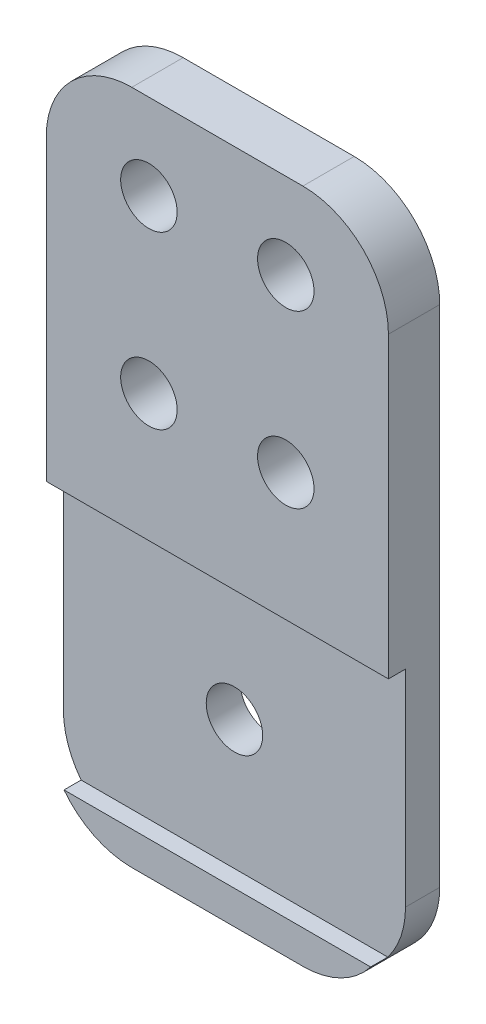
ISO-10303-21;
HEADER;
FILE_DESCRIPTION(('STEP AP214'),'2;1');
FILE_NAME('part.step','',(''),(''),'','','');
FILE_SCHEMA(('AUTOMOTIVE_DESIGN { 1 0 10303 214 1 1 1 1 }'));
ENDSEC;
DATA;
#1=APPLICATION_CONTEXT('core data for automotive mechanical design processes');
#2=APPLICATION_PROTOCOL_DEFINITION('international standard','automotive_design',2000,#1);
#3=PRODUCT_CONTEXT('',#1,'mechanical');
#4=PRODUCT('Part','Part','',(#3));
#5=PRODUCT_RELATED_PRODUCT_CATEGORY('part','',(#4));
#6=PRODUCT_DEFINITION_FORMATION('','',#4);
#7=PRODUCT_DEFINITION_CONTEXT('part definition',#1,'design');
#8=PRODUCT_DEFINITION('design','',#6,#7);
#9=PRODUCT_DEFINITION_SHAPE('','',#8);
#10=(LENGTH_UNIT() NAMED_UNIT(*) SI_UNIT(.MILLI.,.METRE.));
#11=(NAMED_UNIT(*) PLANE_ANGLE_UNIT() SI_UNIT($,.RADIAN.));
#12=(NAMED_UNIT(*) SI_UNIT($,.STERADIAN.) SOLID_ANGLE_UNIT());
#13=UNCERTAINTY_MEASURE_WITH_UNIT(LENGTH_MEASURE(1.E-05),#10,'distance_accuracy_value','');
#14=(GEOMETRIC_REPRESENTATION_CONTEXT(3) GLOBAL_UNCERTAINTY_ASSIGNED_CONTEXT((#13)) GLOBAL_UNIT_ASSIGNED_CONTEXT((#10,
#11,#12)) REPRESENTATION_CONTEXT('',''));
#15=CARTESIAN_POINT('',(0.,0.,0.));
#16=DIRECTION('',(0.,0.,1.));
#17=DIRECTION('',(1.,0.,0.));
#18=AXIS2_PLACEMENT_3D('',#15,#16,#17);
#19=CARTESIAN_POINT('',(0.,0.,3.));
#20=DIRECTION('',(0.,0.,1.));
#21=DIRECTION('',(1.,0.,0.));
#22=AXIS2_PLACEMENT_3D('',#19,#20,#21);
#23=PLANE('',#22);
#24=DIRECTION('',(1.,0.,0.));
#25=VECTOR('',#24,1.);
#26=CARTESIAN_POINT('',(-9.99999999999999,-27.55,3.));
#27=LINE('',#26,#25);
#28=CARTESIAN_POINT('',(-8.96200706713151,-27.55,3.));
#29=VERTEX_POINT('',#28);
#30=CARTESIAN_POINT('',(8.9620070671315,-27.55,3.));
#31=VERTEX_POINT('',#30);
#32=EDGE_CURVE('E143',#29,#31,#27,.T.);
#33=ORIENTED_EDGE('',*,*,#32,.F.);
#34=CARTESIAN_POINT('',(-5.,-24.5,3.));
#35=DIRECTION('',(0.,0.,1.));
#36=DIRECTION('',(1.,0.,0.));
#37=AXIS2_PLACEMENT_3D('',#34,#35,#36);
#38=CIRCLE('',#37,5.);
#39=CARTESIAN_POINT('',(-5.,-29.5,3.));
#40=VERTEX_POINT('',#39);
#41=EDGE_CURVE('E240',#29,#40,#38,.T.);
#42=ORIENTED_EDGE('',*,*,#41,.T.);
#43=DIRECTION('',(1.,0.,0.));
#44=VECTOR('',#43,1.);
#45=CARTESIAN_POINT('',(0.,-29.5,3.));
#46=LINE('',#45,#44);
#47=CARTESIAN_POINT('',(5.,-29.5,3.));
#48=VERTEX_POINT('',#47);
#49=EDGE_CURVE('E179',#40,#48,#46,.T.);
#50=ORIENTED_EDGE('',*,*,#49,.T.);
#51=CARTESIAN_POINT('',(5.,-24.5,3.));
#52=DIRECTION('',(0.,0.,1.));
#53=DIRECTION('',(1.,0.,0.));
#54=AXIS2_PLACEMENT_3D('',#51,#52,#53);
#55=CIRCLE('',#54,5.);
#56=EDGE_CURVE('E238',#48,#31,#55,.T.);
#57=ORIENTED_EDGE('',*,*,#56,.T.);
#58=EDGE_LOOP('',(#33,#42,#50,#57));
#59=FACE_BOUND('',#58,.T.);
#60=ADVANCED_FACE('F41',(#59),#23,.T.);
#61=CARTESIAN_POINT('',(0.,-29.5,3.));
#62=DIRECTION('',(0.,1.,0.));
#63=DIRECTION('',(0.,0.,1.));
#64=AXIS2_PLACEMENT_3D('',#61,#62,#63);
#65=PLANE('',#64);
#66=ORIENTED_EDGE('',*,*,#49,.F.);
#67=DIRECTION('',(0.,0.,-1.));
#68=VECTOR('',#67,1.);
#69=CARTESIAN_POINT('',(-5.,-29.5,0.));
#70=LINE('',#69,#68);
#71=CARTESIAN_POINT('',(-5.,-29.5,0.));
#72=VERTEX_POINT('',#71);
#73=EDGE_CURVE('E215',#40,#72,#70,.T.);
#74=ORIENTED_EDGE('',*,*,#73,.T.);
#75=DIRECTION('',(1.,0.,0.));
#76=VECTOR('',#75,1.);
#77=CARTESIAN_POINT('',(0.,-29.5,0.));
#78=LINE('',#77,#76);
#79=CARTESIAN_POINT('',(5.,-29.5,0.));
#80=VERTEX_POINT('',#79);
#81=EDGE_CURVE('E203',#72,#80,#78,.T.);
#82=ORIENTED_EDGE('',*,*,#81,.T.);
#83=DIRECTION('',(0.,0.,-1.));
#84=VECTOR('',#83,1.);
#85=CARTESIAN_POINT('',(5.,-29.5,3.));
#86=LINE('',#85,#84);
#87=EDGE_CURVE('E188',#80,#48,#86,.F.);
#88=ORIENTED_EDGE('',*,*,#87,.T.);
#89=EDGE_LOOP('',(#66,#74,#82,#88));
#90=FACE_BOUND('',#89,.T.);
#91=ADVANCED_FACE('F274',(#90),#65,.F.);
#92=CARTESIAN_POINT('',(10.,0.,3.));
#93=DIRECTION('',(-1.,0.,0.));
#94=DIRECTION('',(0.,0.,1.));
#95=AXIS2_PLACEMENT_3D('',#92,#93,#94);
#96=PLANE('',#95);
#97=DIRECTION('',(0.,1.,0.));
#98=VECTOR('',#97,1.);
#99=CARTESIAN_POINT('',(10.,-27.55,2.));
#100=LINE('',#99,#98);
#101=CARTESIAN_POINT('',(10.,-24.5,2.));
#102=VERTEX_POINT('',#101);
#103=CARTESIAN_POINT('',(10.,-12.45,2.));
#104=VERTEX_POINT('',#103);
#105=EDGE_CURVE('E130',#102,#104,#100,.T.);
#106=ORIENTED_EDGE('',*,*,#105,.F.);
#107=DIRECTION('',(0.,0.,-1.));
#108=VECTOR('',#107,1.);
#109=CARTESIAN_POINT('',(10.,-24.5,3.));
#110=LINE('',#109,#108);
#111=CARTESIAN_POINT('',(10.,-24.5,0.));
#112=VERTEX_POINT('',#111);
#113=EDGE_CURVE('E244',#102,#112,#110,.T.);
#114=ORIENTED_EDGE('',*,*,#113,.T.);
#115=DIRECTION('',(0.,1.,0.));
#116=VECTOR('',#115,1.);
#117=CARTESIAN_POINT('',(10.,0.,0.));
#118=LINE('',#117,#116);
#119=CARTESIAN_POINT('',(10.,5.,0.));
#120=VERTEX_POINT('',#119);
#121=EDGE_CURVE('E206',#112,#120,#118,.T.);
#122=ORIENTED_EDGE('',*,*,#121,.T.);
#123=DIRECTION('',(0.,0.,-1.));
#124=VECTOR('',#123,1.);
#125=CARTESIAN_POINT('',(10.,5.,3.));
#126=LINE('',#125,#124);
#127=CARTESIAN_POINT('',(10.,5.,3.));
#128=VERTEX_POINT('',#127);
#129=EDGE_CURVE('E242',#120,#128,#126,.F.);
#130=ORIENTED_EDGE('',*,*,#129,.T.);
#131=DIRECTION('',(0.,1.,0.));
#132=VECTOR('',#131,1.);
#133=CARTESIAN_POINT('',(10.,0.,3.));
#134=LINE('',#133,#132);
#135=CARTESIAN_POINT('',(10.,-12.45,3.));
#136=VERTEX_POINT('',#135);
#137=EDGE_CURVE('E155',#136,#128,#134,.T.);
#138=ORIENTED_EDGE('',*,*,#137,.F.);
#139=DIRECTION('',(0.,0.,1.));
#140=VECTOR('',#139,1.);
#141=CARTESIAN_POINT('',(10.,-12.45,2.));
#142=LINE('',#141,#140);
#143=EDGE_CURVE('E147',#104,#136,#142,.T.);
#144=ORIENTED_EDGE('',*,*,#143,.F.);
#145=EDGE_LOOP('',(#106,#114,#122,#130,#138,#144));
#146=FACE_BOUND('',#145,.T.);
#147=ADVANCED_FACE('F154',(#146),#96,.F.);
#148=CARTESIAN_POINT('',(0.,10.,3.));
#149=DIRECTION('',(0.,1.,0.));
#150=DIRECTION('',(-1.,0.,0.));
#151=AXIS2_PLACEMENT_3D('',#148,#149,#150);
#152=PLANE('',#151);
#153=DIRECTION('',(1.,0.,0.));
#154=VECTOR('',#153,1.);
#155=CARTESIAN_POINT('',(0.,10.,3.));
#156=LINE('',#155,#154);
#157=CARTESIAN_POINT('',(-5.,10.,3.));
#158=VERTEX_POINT('',#157);
#159=CARTESIAN_POINT('',(5.,10.,3.));
#160=VERTEX_POINT('',#159);
#161=EDGE_CURVE('E183',#158,#160,#156,.T.);
#162=ORIENTED_EDGE('',*,*,#161,.T.);
#163=DIRECTION('',(0.,0.,-1.));
#164=VECTOR('',#163,1.);
#165=CARTESIAN_POINT('',(5.,10.,0.));
#166=LINE('',#165,#164);
#167=CARTESIAN_POINT('',(5.,10.,0.));
#168=VERTEX_POINT('',#167);
#169=EDGE_CURVE('E247',#160,#168,#166,.T.);
#170=ORIENTED_EDGE('',*,*,#169,.T.);
#171=DIRECTION('',(1.,0.,0.));
#172=VECTOR('',#171,1.);
#173=CARTESIAN_POINT('',(0.,10.,0.));
#174=LINE('',#173,#172);
#175=CARTESIAN_POINT('',(-5.,10.,0.));
#176=VERTEX_POINT('',#175);
#177=EDGE_CURVE('E209',#176,#168,#174,.T.);
#178=ORIENTED_EDGE('',*,*,#177,.F.);
#179=DIRECTION('',(0.,0.,-1.));
#180=VECTOR('',#179,1.);
#181=CARTESIAN_POINT('',(-5.,10.,3.));
#182=LINE('',#181,#180);
#183=EDGE_CURVE('E61',#176,#158,#182,.F.);
#184=ORIENTED_EDGE('',*,*,#183,.T.);
#185=EDGE_LOOP('',(#162,#170,#178,#184));
#186=FACE_BOUND('',#185,.T.);
#187=ADVANCED_FACE('F261',(#186),#152,.T.);
#188=CARTESIAN_POINT('',(-4.,5.,3.));
#189=DIRECTION('',(0.,0.,-1.));
#190=DIRECTION('',(-1.,0.,0.));
#191=AXIS2_PLACEMENT_3D('',#188,#189,#190);
#192=CYLINDRICAL_SURFACE('',#191,1.65);
#193=CARTESIAN_POINT('',(-4.,5.,3.));
#194=DIRECTION('',(0.,0.,1.));
#195=DIRECTION('',(1.,0.,0.));
#196=AXIS2_PLACEMENT_3D('',#193,#194,#195);
#197=CIRCLE('',#196,1.65);
#198=CARTESIAN_POINT('',(-2.35,5.,3.));
#199=VERTEX_POINT('',#198);
#200=EDGE_CURVE('E176',#199,#199,#197,.T.);
#201=ORIENTED_EDGE('',*,*,#200,.T.);
#202=EDGE_LOOP('',(#201));
#203=FACE_BOUND('',#202,.T.);
#204=CARTESIAN_POINT('',(-4.,5.,0.));
#205=DIRECTION('',(0.,0.,1.));
#206=DIRECTION('',(1.,0.,0.));
#207=AXIS2_PLACEMENT_3D('',#204,#205,#206);
#208=CIRCLE('',#207,1.65);
#209=CARTESIAN_POINT('',(-2.35,5.,0.));
#210=VERTEX_POINT('',#209);
#211=EDGE_CURVE('E200',#210,#210,#208,.T.);
#212=ORIENTED_EDGE('',*,*,#211,.F.);
#213=EDGE_LOOP('',(#212));
#214=FACE_BOUND('',#213,.T.);
#215=ADVANCED_FACE('F317',(#203,#214),#192,.F.);
#216=CARTESIAN_POINT('',(-4.,-5.,3.));
#217=DIRECTION('',(0.,0.,-1.));
#218=DIRECTION('',(-1.,0.,0.));
#219=AXIS2_PLACEMENT_3D('',#216,#217,#218);
#220=CYLINDRICAL_SURFACE('',#219,1.65);
#221=CARTESIAN_POINT('',(-4.,-5.,3.));
#222=DIRECTION('',(0.,0.,1.));
#223=DIRECTION('',(1.,0.,0.));
#224=AXIS2_PLACEMENT_3D('',#221,#222,#223);
#225=CIRCLE('',#224,1.65);
#226=CARTESIAN_POINT('',(-2.35,-5.,3.));
#227=VERTEX_POINT('',#226);
#228=EDGE_CURVE('E173',#227,#227,#225,.T.);
#229=ORIENTED_EDGE('',*,*,#228,.T.);
#230=EDGE_LOOP('',(#229));
#231=FACE_BOUND('',#230,.T.);
#232=CARTESIAN_POINT('',(-4.,-5.,0.));
#233=DIRECTION('',(0.,0.,1.));
#234=DIRECTION('',(1.,0.,0.));
#235=AXIS2_PLACEMENT_3D('',#232,#233,#234);
#236=CIRCLE('',#235,1.65);
#237=CARTESIAN_POINT('',(-2.35,-5.,0.));
#238=VERTEX_POINT('',#237);
#239=EDGE_CURVE('E197',#238,#238,#236,.T.);
#240=ORIENTED_EDGE('',*,*,#239,.F.);
#241=EDGE_LOOP('',(#240));
#242=FACE_BOUND('',#241,.T.);
#243=ADVANCED_FACE('F322',(#231,#242),#220,.F.);
#244=CARTESIAN_POINT('',(4.,-5.,3.));
#245=DIRECTION('',(0.,0.,-1.));
#246=DIRECTION('',(-1.,0.,0.));
#247=AXIS2_PLACEMENT_3D('',#244,#245,#246);
#248=CYLINDRICAL_SURFACE('',#247,1.65);
#249=CARTESIAN_POINT('',(4.,-5.,3.));
#250=DIRECTION('',(0.,0.,1.));
#251=DIRECTION('',(1.,0.,0.));
#252=AXIS2_PLACEMENT_3D('',#249,#250,#251);
#253=CIRCLE('',#252,1.65);
#254=CARTESIAN_POINT('',(5.65,-5.,3.));
#255=VERTEX_POINT('',#254);
#256=EDGE_CURVE('E169',#255,#255,#253,.T.);
#257=ORIENTED_EDGE('',*,*,#256,.T.);
#258=EDGE_LOOP('',(#257));
#259=FACE_BOUND('',#258,.T.);
#260=CARTESIAN_POINT('',(4.,-5.,0.));
#261=DIRECTION('',(0.,0.,1.));
#262=DIRECTION('',(1.,0.,0.));
#263=AXIS2_PLACEMENT_3D('',#260,#261,#262);
#264=CIRCLE('',#263,1.65);
#265=CARTESIAN_POINT('',(5.65,-5.,0.));
#266=VERTEX_POINT('',#265);
#267=EDGE_CURVE('E194',#266,#266,#264,.T.);
#268=ORIENTED_EDGE('',*,*,#267,.F.);
#269=EDGE_LOOP('',(#268));
#270=FACE_BOUND('',#269,.T.);
#271=ADVANCED_FACE('F326',(#259,#270),#248,.F.);
#272=CARTESIAN_POINT('',(4.,5.,3.));
#273=DIRECTION('',(0.,0.,-1.));
#274=DIRECTION('',(-1.,0.,0.));
#275=AXIS2_PLACEMENT_3D('',#272,#273,#274);
#276=CYLINDRICAL_SURFACE('',#275,1.65);
#277=CARTESIAN_POINT('',(4.,5.,3.));
#278=DIRECTION('',(0.,0.,1.));
#279=DIRECTION('',(1.,0.,0.));
#280=AXIS2_PLACEMENT_3D('',#277,#278,#279);
#281=CIRCLE('',#280,1.65);
#282=CARTESIAN_POINT('',(5.65,5.,3.));
#283=VERTEX_POINT('',#282);
#284=EDGE_CURVE('E166',#283,#283,#281,.T.);
#285=ORIENTED_EDGE('',*,*,#284,.T.);
#286=EDGE_LOOP('',(#285));
#287=FACE_BOUND('',#286,.T.);
#288=CARTESIAN_POINT('',(4.,5.,0.));
#289=DIRECTION('',(0.,0.,1.));
#290=DIRECTION('',(1.,0.,0.));
#291=AXIS2_PLACEMENT_3D('',#288,#289,#290);
#292=CIRCLE('',#291,1.65);
#293=CARTESIAN_POINT('',(5.65,5.,0.));
#294=VERTEX_POINT('',#293);
#295=EDGE_CURVE('E191',#294,#294,#292,.T.);
#296=ORIENTED_EDGE('',*,*,#295,.F.);
#297=EDGE_LOOP('',(#296));
#298=FACE_BOUND('',#297,.T.);
#299=ADVANCED_FACE('F312',(#287,#298),#276,.F.);
#300=CARTESIAN_POINT('',(0.,-20.,3.));
#301=DIRECTION('',(0.,0.,-1.));
#302=DIRECTION('',(-1.,0.,0.));
#303=AXIS2_PLACEMENT_3D('',#300,#301,#302);
#304=CYLINDRICAL_SURFACE('',#303,1.65);
#305=CARTESIAN_POINT('',(0.,-20.,2.));
#306=DIRECTION('',(0.,0.,-1.));
#307=DIRECTION('',(-1.,0.,0.));
#308=AXIS2_PLACEMENT_3D('',#305,#306,#307);
#309=CIRCLE('',#308,1.65);
#310=CARTESIAN_POINT('',(-1.65,-20.,2.));
#311=VERTEX_POINT('',#310);
#312=EDGE_CURVE('E158',#311,#311,#309,.T.);
#313=ORIENTED_EDGE('',*,*,#312,.F.);
#314=EDGE_LOOP('',(#313));
#315=FACE_BOUND('',#314,.T.);
#316=CARTESIAN_POINT('',(0.,-20.,0.));
#317=DIRECTION('',(0.,0.,1.));
#318=DIRECTION('',(1.,0.,0.));
#319=AXIS2_PLACEMENT_3D('',#316,#317,#318);
#320=CIRCLE('',#319,1.65);
#321=CARTESIAN_POINT('',(1.65,-20.,0.));
#322=VERTEX_POINT('',#321);
#323=EDGE_CURVE('E165',#322,#322,#320,.T.);
#324=ORIENTED_EDGE('',*,*,#323,.F.);
#325=EDGE_LOOP('',(#324));
#326=FACE_BOUND('',#325,.T.);
#327=ADVANCED_FACE('F306',(#315,#326),#304,.F.);
#328=CARTESIAN_POINT('',(-10.,0.,3.));
#329=DIRECTION('',(-1.,0.,0.));
#330=DIRECTION('',(0.,0.,1.));
#331=AXIS2_PLACEMENT_3D('',#328,#329,#330);
#332=PLANE('',#331);
#333=DIRECTION('',(0.,1.,0.));
#334=VECTOR('',#333,1.);
#335=CARTESIAN_POINT('',(-10.,0.,0.));
#336=LINE('',#335,#334);
#337=CARTESIAN_POINT('',(-10.,-24.5,0.));
#338=VERTEX_POINT('',#337);
#339=CARTESIAN_POINT('',(-10.,5.,0.));
#340=VERTEX_POINT('',#339);
#341=EDGE_CURVE('E170',#338,#340,#336,.T.);
#342=ORIENTED_EDGE('',*,*,#341,.F.);
#343=DIRECTION('',(0.,0.,-1.));
#344=VECTOR('',#343,1.);
#345=CARTESIAN_POINT('',(-10.,-24.5,3.));
#346=LINE('',#345,#344);
#347=CARTESIAN_POINT('',(-9.99999999999999,-24.5,2.));
#348=VERTEX_POINT('',#347);
#349=EDGE_CURVE('E229',#338,#348,#346,.F.);
#350=ORIENTED_EDGE('',*,*,#349,.T.);
#351=DIRECTION('',(0.,-1.,0.));
#352=VECTOR('',#351,1.);
#353=CARTESIAN_POINT('',(-9.99999999999999,-27.55,2.));
#354=LINE('',#353,#352);
#355=CARTESIAN_POINT('',(-9.99999999999999,-12.45,2.));
#356=VERTEX_POINT('',#355);
#357=EDGE_CURVE('E151',#356,#348,#354,.T.);
#358=ORIENTED_EDGE('',*,*,#357,.F.);
#359=DIRECTION('',(0.,0.,1.));
#360=VECTOR('',#359,1.);
#361=CARTESIAN_POINT('',(-9.99999999999999,-12.45,2.));
#362=LINE('',#361,#360);
#363=CARTESIAN_POINT('',(-9.99999999999999,-12.45,3.));
#364=VERTEX_POINT('',#363);
#365=EDGE_CURVE('E150',#356,#364,#362,.T.);
#366=ORIENTED_EDGE('',*,*,#365,.T.);
#367=DIRECTION('',(0.,1.,0.));
#368=VECTOR('',#367,1.);
#369=CARTESIAN_POINT('',(-10.,0.,3.));
#370=LINE('',#369,#368);
#371=CARTESIAN_POINT('',(-10.,5.,3.));
#372=VERTEX_POINT('',#371);
#373=EDGE_CURVE('E185',#364,#372,#370,.T.);
#374=ORIENTED_EDGE('',*,*,#373,.T.);
#375=DIRECTION('',(0.,0.,-1.));
#376=VECTOR('',#375,1.);
#377=CARTESIAN_POINT('',(-10.,5.,3.));
#378=LINE('',#377,#376);
#379=EDGE_CURVE('E226',#372,#340,#378,.T.);
#380=ORIENTED_EDGE('',*,*,#379,.T.);
#381=EDGE_LOOP('',(#342,#350,#358,#366,#374,#380));
#382=FACE_BOUND('',#381,.T.);
#383=ADVANCED_FACE('F257',(#382),#332,.T.);
#384=ORIENTED_EDGE('',*,*,#137,.T.);
#385=CARTESIAN_POINT('',(5.,5.,3.));
#386=DIRECTION('',(0.,0.,1.));
#387=DIRECTION('',(1.,0.,0.));
#388=AXIS2_PLACEMENT_3D('',#385,#386,#387);
#389=CIRCLE('',#388,5.);
#390=EDGE_CURVE('E11',#128,#160,#389,.T.);
#391=ORIENTED_EDGE('',*,*,#390,.T.);
#392=ORIENTED_EDGE('',*,*,#161,.F.);
#393=CARTESIAN_POINT('',(-5.,5.,3.));
#394=DIRECTION('',(0.,0.,1.));
#395=DIRECTION('',(1.,0.,0.));
#396=AXIS2_PLACEMENT_3D('',#393,#394,#395);
#397=CIRCLE('',#396,5.);
#398=EDGE_CURVE('E49',#158,#372,#397,.T.);
#399=ORIENTED_EDGE('',*,*,#398,.T.);
#400=ORIENTED_EDGE('',*,*,#373,.F.);
#401=DIRECTION('',(-1.,0.,0.));
#402=VECTOR('',#401,1.);
#403=CARTESIAN_POINT('',(-9.99999999999999,-12.45,3.));
#404=LINE('',#403,#402);
#405=EDGE_CURVE('E289',#136,#364,#404,.T.);
#406=ORIENTED_EDGE('',*,*,#405,.F.);
#407=EDGE_LOOP('',(#384,#391,#392,#399,#400,#406));
#408=FACE_BOUND('',#407,.T.);
#409=ORIENTED_EDGE('',*,*,#284,.F.);
#410=EDGE_LOOP('',(#409));
#411=FACE_BOUND('',#410,.T.);
#412=ORIENTED_EDGE('',*,*,#256,.F.);
#413=EDGE_LOOP('',(#412));
#414=FACE_BOUND('',#413,.T.);
#415=ORIENTED_EDGE('',*,*,#228,.F.);
#416=EDGE_LOOP('',(#415));
#417=FACE_BOUND('',#416,.T.);
#418=ORIENTED_EDGE('',*,*,#200,.F.);
#419=EDGE_LOOP('',(#418));
#420=FACE_BOUND('',#419,.T.);
#421=ADVANCED_FACE('F251',(#408,#411,#414,#417,#420),#23,.T.);
#422=CARTESIAN_POINT('',(0.,0.,0.));
#423=DIRECTION('',(0.,0.,1.));
#424=DIRECTION('',(1.,0.,0.));
#425=AXIS2_PLACEMENT_3D('',#422,#423,#424);
#426=PLANE('',#425);
#427=ORIENTED_EDGE('',*,*,#323,.T.);
#428=EDGE_LOOP('',(#427));
#429=FACE_BOUND('',#428,.T.);
#430=ORIENTED_EDGE('',*,*,#295,.T.);
#431=EDGE_LOOP('',(#430));
#432=FACE_BOUND('',#431,.T.);
#433=ORIENTED_EDGE('',*,*,#267,.T.);
#434=EDGE_LOOP('',(#433));
#435=FACE_BOUND('',#434,.T.);
#436=ORIENTED_EDGE('',*,*,#239,.T.);
#437=EDGE_LOOP('',(#436));
#438=FACE_BOUND('',#437,.T.);
#439=ORIENTED_EDGE('',*,*,#211,.T.);
#440=EDGE_LOOP('',(#439));
#441=FACE_BOUND('',#440,.T.);
#442=ORIENTED_EDGE('',*,*,#81,.F.);
#443=CARTESIAN_POINT('',(-5.,-24.5,0.));
#444=DIRECTION('',(0.,0.,1.));
#445=DIRECTION('',(1.,0.,0.));
#446=AXIS2_PLACEMENT_3D('',#443,#444,#445);
#447=CIRCLE('',#446,5.);
#448=EDGE_CURVE('E224',#72,#338,#447,.F.);
#449=ORIENTED_EDGE('',*,*,#448,.T.);
#450=ORIENTED_EDGE('',*,*,#341,.T.);
#451=CARTESIAN_POINT('',(-5.,5.,0.));
#452=DIRECTION('',(0.,0.,1.));
#453=DIRECTION('',(1.,0.,0.));
#454=AXIS2_PLACEMENT_3D('',#451,#452,#453);
#455=CIRCLE('',#454,5.);
#456=EDGE_CURVE('E218',#340,#176,#455,.F.);
#457=ORIENTED_EDGE('',*,*,#456,.T.);
#458=ORIENTED_EDGE('',*,*,#177,.T.);
#459=CARTESIAN_POINT('',(5.,5.,0.));
#460=DIRECTION('',(0.,0.,1.));
#461=DIRECTION('',(1.,0.,0.));
#462=AXIS2_PLACEMENT_3D('',#459,#460,#461);
#463=CIRCLE('',#462,5.);
#464=EDGE_CURVE('E220',#168,#120,#463,.F.);
#465=ORIENTED_EDGE('',*,*,#464,.T.);
#466=ORIENTED_EDGE('',*,*,#121,.F.);
#467=CARTESIAN_POINT('',(5.,-24.5,0.));
#468=DIRECTION('',(0.,0.,1.));
#469=DIRECTION('',(1.,0.,0.));
#470=AXIS2_PLACEMENT_3D('',#467,#468,#469);
#471=CIRCLE('',#470,5.);
#472=EDGE_CURVE('E222',#112,#80,#471,.F.);
#473=ORIENTED_EDGE('',*,*,#472,.T.);
#474=EDGE_LOOP('',(#442,#449,#450,#457,#458,#465,#466,#473));
#475=FACE_BOUND('',#474,.T.);
#476=ADVANCED_FACE('F260',(#429,#432,#435,#438,#441,#475),#426,.F.);
#477=CARTESIAN_POINT('',(-9.99999999999999,-27.55,2.));
#478=DIRECTION('',(0.,-1.,0.));
#479=DIRECTION('',(0.,0.,-1.));
#480=AXIS2_PLACEMENT_3D('',#477,#478,#479);
#481=PLANE('',#480);
#482=DIRECTION('',(1.,0.,0.));
#483=VECTOR('',#482,1.);
#484=CARTESIAN_POINT('',(-9.99999999999999,-27.55,2.));
#485=LINE('',#484,#483);
#486=CARTESIAN_POINT('',(-8.96200706713151,-27.55,2.));
#487=VERTEX_POINT('',#486);
#488=CARTESIAN_POINT('',(8.96200706713151,-27.55,2.));
#489=VERTEX_POINT('',#488);
#490=EDGE_CURVE('E156',#487,#489,#485,.T.);
#491=ORIENTED_EDGE('',*,*,#490,.F.);
#492=DIRECTION('',(0.,0.,1.));
#493=VECTOR('',#492,1.);
#494=CARTESIAN_POINT('',(-8.96200706713151,-27.55,2.));
#495=LINE('',#494,#493);
#496=EDGE_CURVE('E236',#487,#29,#495,.T.);
#497=ORIENTED_EDGE('',*,*,#496,.T.);
#498=ORIENTED_EDGE('',*,*,#32,.T.);
#499=DIRECTION('',(0.,0.,-1.));
#500=VECTOR('',#499,1.);
#501=CARTESIAN_POINT('',(8.96200706713151,-27.55,3.));
#502=LINE('',#501,#500);
#503=EDGE_CURVE('E234',#31,#489,#502,.T.);
#504=ORIENTED_EDGE('',*,*,#503,.T.);
#505=EDGE_LOOP('',(#491,#497,#498,#504));
#506=FACE_BOUND('',#505,.T.);
#507=ADVANCED_FACE('F287',(#506),#481,.F.);
#508=CARTESIAN_POINT('',(-9.99999999999999,-12.45,2.));
#509=DIRECTION('',(0.,1.,0.));
#510=DIRECTION('',(0.,0.,1.));
#511=AXIS2_PLACEMENT_3D('',#508,#509,#510);
#512=PLANE('',#511);
#513=ORIENTED_EDGE('',*,*,#405,.T.);
#514=ORIENTED_EDGE('',*,*,#365,.F.);
#515=DIRECTION('',(-1.,0.,0.));
#516=VECTOR('',#515,1.);
#517=CARTESIAN_POINT('',(-9.99999999999999,-12.45,2.));
#518=LINE('',#517,#516);
#519=EDGE_CURVE('E134',#104,#356,#518,.T.);
#520=ORIENTED_EDGE('',*,*,#519,.F.);
#521=ORIENTED_EDGE('',*,*,#143,.T.);
#522=EDGE_LOOP('',(#513,#514,#520,#521));
#523=FACE_BOUND('',#522,.T.);
#524=ADVANCED_FACE('F146',(#523),#512,.F.);
#525=CARTESIAN_POINT('',(0.,0.,2.));
#526=DIRECTION('',(0.,0.,-1.));
#527=DIRECTION('',(-1.,0.,0.));
#528=AXIS2_PLACEMENT_3D('',#525,#526,#527);
#529=PLANE('',#528);
#530=ORIENTED_EDGE('',*,*,#312,.T.);
#531=EDGE_LOOP('',(#530));
#532=FACE_BOUND('',#531,.T.);
#533=ORIENTED_EDGE('',*,*,#357,.T.);
#534=CARTESIAN_POINT('',(-5.,-24.5,2.));
#535=DIRECTION('',(0.,0.,-1.));
#536=DIRECTION('',(-1.,0.,0.));
#537=AXIS2_PLACEMENT_3D('',#534,#535,#536);
#538=CIRCLE('',#537,5.);
#539=EDGE_CURVE('E232',#348,#487,#538,.F.);
#540=ORIENTED_EDGE('',*,*,#539,.T.);
#541=ORIENTED_EDGE('',*,*,#490,.T.);
#542=CARTESIAN_POINT('',(5.,-24.5,2.));
#543=DIRECTION('',(0.,0.,-1.));
#544=DIRECTION('',(-1.,0.,0.));
#545=AXIS2_PLACEMENT_3D('',#542,#543,#544);
#546=CIRCLE('',#545,5.);
#547=EDGE_CURVE('E138',#489,#102,#546,.F.);
#548=ORIENTED_EDGE('',*,*,#547,.T.);
#549=ORIENTED_EDGE('',*,*,#105,.T.);
#550=ORIENTED_EDGE('',*,*,#519,.T.);
#551=EDGE_LOOP('',(#533,#540,#541,#548,#549,#550));
#552=FACE_BOUND('',#551,.T.);
#553=ADVANCED_FACE('F133',(#532,#552),#529,.F.);
#554=CARTESIAN_POINT('',(-5.,-24.5,3.));
#555=DIRECTION('',(0.,0.,1.));
#556=DIRECTION('',(1.,0.,0.));
#557=AXIS2_PLACEMENT_3D('',#554,#555,#556);
#558=CYLINDRICAL_SURFACE('',#557,5.);
#559=ORIENTED_EDGE('',*,*,#539,.F.);
#560=ORIENTED_EDGE('',*,*,#349,.F.);
#561=ORIENTED_EDGE('',*,*,#448,.F.);
#562=ORIENTED_EDGE('',*,*,#73,.F.);
#563=ORIENTED_EDGE('',*,*,#41,.F.);
#564=ORIENTED_EDGE('',*,*,#496,.F.);
#565=EDGE_LOOP('',(#559,#560,#561,#562,#563,#564));
#566=FACE_BOUND('',#565,.T.);
#567=ADVANCED_FACE('F279',(#566),#558,.T.);
#568=CARTESIAN_POINT('',(5.,-24.5,3.));
#569=DIRECTION('',(0.,0.,-1.));
#570=DIRECTION('',(-1.,0.,0.));
#571=AXIS2_PLACEMENT_3D('',#568,#569,#570);
#572=CYLINDRICAL_SURFACE('',#571,5.);
#573=ORIENTED_EDGE('',*,*,#56,.F.);
#574=ORIENTED_EDGE('',*,*,#87,.F.);
#575=ORIENTED_EDGE('',*,*,#472,.F.);
#576=ORIENTED_EDGE('',*,*,#113,.F.);
#577=ORIENTED_EDGE('',*,*,#547,.F.);
#578=ORIENTED_EDGE('',*,*,#503,.F.);
#579=EDGE_LOOP('',(#573,#574,#575,#576,#577,#578));
#580=FACE_BOUND('',#579,.T.);
#581=ADVANCED_FACE('F269',(#580),#572,.T.);
#582=CARTESIAN_POINT('',(5.,5.,3.));
#583=DIRECTION('',(0.,0.,1.));
#584=DIRECTION('',(1.,0.,0.));
#585=AXIS2_PLACEMENT_3D('',#582,#583,#584);
#586=CYLINDRICAL_SURFACE('',#585,5.);
#587=ORIENTED_EDGE('',*,*,#390,.F.);
#588=ORIENTED_EDGE('',*,*,#129,.F.);
#589=ORIENTED_EDGE('',*,*,#464,.F.);
#590=ORIENTED_EDGE('',*,*,#169,.F.);
#591=EDGE_LOOP('',(#587,#588,#589,#590));
#592=FACE_BOUND('',#591,.T.);
#593=ADVANCED_FACE('F264',(#592),#586,.T.);
#594=CARTESIAN_POINT('',(-5.,5.,3.));
#595=DIRECTION('',(0.,0.,-1.));
#596=DIRECTION('',(-1.,0.,0.));
#597=AXIS2_PLACEMENT_3D('',#594,#595,#596);
#598=CYLINDRICAL_SURFACE('',#597,5.);
#599=ORIENTED_EDGE('',*,*,#398,.F.);
#600=ORIENTED_EDGE('',*,*,#183,.F.);
#601=ORIENTED_EDGE('',*,*,#456,.F.);
#602=ORIENTED_EDGE('',*,*,#379,.F.);
#603=EDGE_LOOP('',(#599,#600,#601,#602));
#604=FACE_BOUND('',#603,.T.);
#605=ADVANCED_FACE('F43',(#604),#598,.T.);
#606=CLOSED_SHELL('',(#60,#91,#147,#187,#215,#243,#271,#299,#327,#383,#421,#476,#507,#524,#553,
#567,#581,#593,#605));
#607=MANIFOLD_SOLID_BREP('B2',#606);
#608=ADVANCED_BREP_SHAPE_REPRESENTATION('',(#18,#607),#14);
#609=SHAPE_DEFINITION_REPRESENTATION(#9,#608);
ENDSEC;
END-ISO-10303-21;
